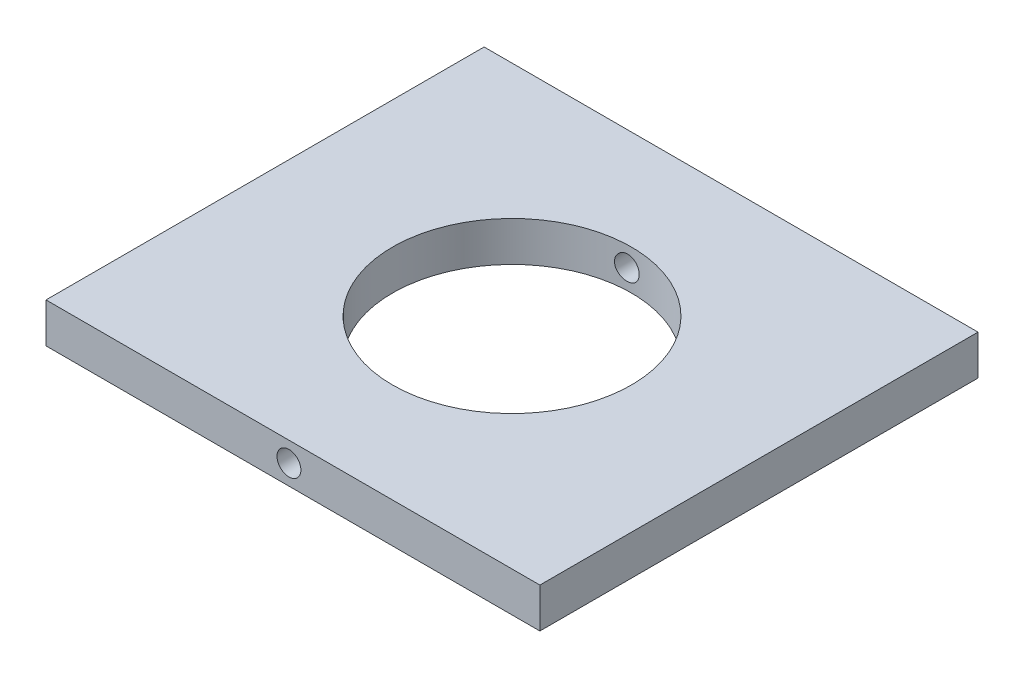
ISO-10303-21;
HEADER;
FILE_DESCRIPTION(('STEP AP214'),'2;1');
FILE_NAME('part.step','',(''),(''),'','','');
FILE_SCHEMA(('AUTOMOTIVE_DESIGN { 1 0 10303 214 1 1 1 1 }'));
ENDSEC;
DATA;
#1=APPLICATION_CONTEXT('core data for automotive mechanical design processes');
#2=APPLICATION_PROTOCOL_DEFINITION('international standard','automotive_design',2000,#1);
#3=PRODUCT_CONTEXT('',#1,'mechanical');
#4=PRODUCT('Part','Part','',(#3));
#5=PRODUCT_RELATED_PRODUCT_CATEGORY('part','',(#4));
#6=PRODUCT_DEFINITION_FORMATION('','',#4);
#7=PRODUCT_DEFINITION_CONTEXT('part definition',#1,'design');
#8=PRODUCT_DEFINITION('design','',#6,#7);
#9=PRODUCT_DEFINITION_SHAPE('','',#8);
#10=(LENGTH_UNIT() NAMED_UNIT(*) SI_UNIT(.MILLI.,.METRE.));
#11=(NAMED_UNIT(*) PLANE_ANGLE_UNIT() SI_UNIT($,.RADIAN.));
#12=(NAMED_UNIT(*) SI_UNIT($,.STERADIAN.) SOLID_ANGLE_UNIT());
#13=UNCERTAINTY_MEASURE_WITH_UNIT(LENGTH_MEASURE(1.E-05),#10,'distance_accuracy_value','');
#14=(GEOMETRIC_REPRESENTATION_CONTEXT(3) GLOBAL_UNCERTAINTY_ASSIGNED_CONTEXT((#13)) GLOBAL_UNIT_ASSIGNED_CONTEXT((#10,
#11,#12)) REPRESENTATION_CONTEXT('',''));
#15=CARTESIAN_POINT('',(0.,0.,0.));
#16=DIRECTION('',(0.,0.,1.));
#17=DIRECTION('',(1.,0.,0.));
#18=AXIS2_PLACEMENT_3D('',#15,#16,#17);
#19=CARTESIAN_POINT('',(-9.49999999999999,-45.,55.));
#20=DIRECTION('',(1.,0.,0.));
#21=DIRECTION('',(0.,0.,-1.));
#22=AXIS2_PLACEMENT_3D('',#19,#20,#21);
#23=PLANE('',#22);
#24=DIRECTION('',(0.,-1.,0.));
#25=VECTOR('',#24,1.);
#26=CARTESIAN_POINT('',(-9.49999999999999,-45.,0.));
#27=LINE('',#26,#25);
#28=CARTESIAN_POINT('',(-9.49999999999999,-45.,0.));
#29=VERTEX_POINT('',#28);
#30=CARTESIAN_POINT('',(-9.49999999999999,-50.,0.));
#31=VERTEX_POINT('',#30);
#32=EDGE_CURVE('E115',#29,#31,#27,.T.);
#33=ORIENTED_EDGE('',*,*,#32,.T.);
#34=DIRECTION('',(0.,0.,-1.));
#35=VECTOR('',#34,1.);
#36=CARTESIAN_POINT('',(-9.49999999999999,-50.,55.));
#37=LINE('',#36,#35);
#38=CARTESIAN_POINT('',(-9.49999999999999,-50.,55.));
#39=VERTEX_POINT('',#38);
#40=EDGE_CURVE('E11',#39,#31,#37,.T.);
#41=ORIENTED_EDGE('',*,*,#40,.F.);
#42=DIRECTION('',(0.,-1.,0.));
#43=VECTOR('',#42,1.);
#44=CARTESIAN_POINT('',(-9.49999999999999,-45.,55.));
#45=LINE('',#44,#43);
#46=CARTESIAN_POINT('',(-9.49999999999999,-45.,55.));
#47=VERTEX_POINT('',#46);
#48=EDGE_CURVE('E96',#47,#39,#45,.T.);
#49=ORIENTED_EDGE('',*,*,#48,.F.);
#50=DIRECTION('',(0.,0.,-1.));
#51=VECTOR('',#50,1.);
#52=CARTESIAN_POINT('',(-9.49999999999999,-45.,55.));
#53=LINE('',#52,#51);
#54=EDGE_CURVE('E63',#47,#29,#53,.T.);
#55=ORIENTED_EDGE('',*,*,#54,.T.);
#56=EDGE_LOOP('',(#33,#41,#49,#55));
#57=FACE_BOUND('',#56,.T.);
#58=ADVANCED_FACE('F39',(#57),#23,.F.);
#59=CARTESIAN_POINT('',(-9.49999999999999,-50.,55.));
#60=DIRECTION('',(0.,1.,0.));
#61=DIRECTION('',(0.,0.,1.));
#62=AXIS2_PLACEMENT_3D('',#59,#60,#61);
#63=PLANE('',#62);
#64=CARTESIAN_POINT('',(21.5,-50.,27.5));
#65=DIRECTION('',(0.,1.,0.));
#66=DIRECTION('',(0.,0.,1.));
#67=AXIS2_PLACEMENT_3D('',#64,#65,#66);
#68=CIRCLE('',#67,15.);
#69=CARTESIAN_POINT('',(21.5,-50.,42.5));
#70=VERTEX_POINT('',#69);
#71=EDGE_CURVE('E118',#70,#70,#68,.T.);
#72=ORIENTED_EDGE('',*,*,#71,.T.);
#73=EDGE_LOOP('',(#72));
#74=FACE_BOUND('',#73,.T.);
#75=DIRECTION('',(1.,0.,0.));
#76=VECTOR('',#75,1.);
#77=CARTESIAN_POINT('',(-9.49999999999999,-50.,0.));
#78=LINE('',#77,#76);
#79=CARTESIAN_POINT('',(52.5,-50.,0.));
#80=VERTEX_POINT('',#79);
#81=EDGE_CURVE('E102',#31,#80,#78,.T.);
#82=ORIENTED_EDGE('',*,*,#81,.T.);
#83=DIRECTION('',(0.,0.,-1.));
#84=VECTOR('',#83,1.);
#85=CARTESIAN_POINT('',(52.5,-50.,55.));
#86=LINE('',#85,#84);
#87=CARTESIAN_POINT('',(52.5,-50.,55.));
#88=VERTEX_POINT('',#87);
#89=EDGE_CURVE('E54',#88,#80,#86,.T.);
#90=ORIENTED_EDGE('',*,*,#89,.F.);
#91=DIRECTION('',(1.,0.,0.));
#92=VECTOR('',#91,1.);
#93=CARTESIAN_POINT('',(-9.49999999999999,-50.,55.));
#94=LINE('',#93,#92);
#95=EDGE_CURVE('E88',#39,#88,#94,.T.);
#96=ORIENTED_EDGE('',*,*,#95,.F.);
#97=ORIENTED_EDGE('',*,*,#40,.T.);
#98=EDGE_LOOP('',(#82,#90,#96,#97));
#99=FACE_BOUND('',#98,.T.);
#100=ADVANCED_FACE('F101',(#74,#99),#63,.F.);
#101=CARTESIAN_POINT('',(52.5,-45.,55.));
#102=DIRECTION('',(1.,0.,0.));
#103=DIRECTION('',(0.,0.,-1.));
#104=AXIS2_PLACEMENT_3D('',#101,#102,#103);
#105=PLANE('',#104);
#106=DIRECTION('',(0.,-1.,0.));
#107=VECTOR('',#106,1.);
#108=CARTESIAN_POINT('',(52.5,-45.,0.));
#109=LINE('',#108,#107);
#110=CARTESIAN_POINT('',(52.5,-45.,0.));
#111=VERTEX_POINT('',#110);
#112=EDGE_CURVE('E121',#111,#80,#109,.T.);
#113=ORIENTED_EDGE('',*,*,#112,.F.);
#114=DIRECTION('',(0.,0.,-1.));
#115=VECTOR('',#114,1.);
#116=CARTESIAN_POINT('',(52.5,-45.,55.));
#117=LINE('',#116,#115);
#118=CARTESIAN_POINT('',(52.5,-45.,55.));
#119=VERTEX_POINT('',#118);
#120=EDGE_CURVE('E77',#119,#111,#117,.T.);
#121=ORIENTED_EDGE('',*,*,#120,.F.);
#122=DIRECTION('',(0.,-1.,0.));
#123=VECTOR('',#122,1.);
#124=CARTESIAN_POINT('',(52.5,-45.,55.));
#125=LINE('',#124,#123);
#126=EDGE_CURVE('E95',#119,#88,#125,.T.);
#127=ORIENTED_EDGE('',*,*,#126,.T.);
#128=ORIENTED_EDGE('',*,*,#89,.T.);
#129=EDGE_LOOP('',(#113,#121,#127,#128));
#130=FACE_BOUND('',#129,.T.);
#131=ADVANCED_FACE('F107',(#130),#105,.T.);
#132=CARTESIAN_POINT('',(-9.49999999999999,-45.,55.));
#133=DIRECTION('',(0.,1.,0.));
#134=DIRECTION('',(0.,0.,1.));
#135=AXIS2_PLACEMENT_3D('',#132,#133,#134);
#136=PLANE('',#135);
#137=CARTESIAN_POINT('',(21.5,-45.,27.5));
#138=DIRECTION('',(0.,1.,0.));
#139=DIRECTION('',(0.,0.,1.));
#140=AXIS2_PLACEMENT_3D('',#137,#138,#139);
#141=CIRCLE('',#140,15.);
#142=CARTESIAN_POINT('',(21.5,-45.,42.5));
#143=VERTEX_POINT('',#142);
#144=EDGE_CURVE('E189',#143,#143,#141,.T.);
#145=ORIENTED_EDGE('',*,*,#144,.F.);
#146=EDGE_LOOP('',(#145));
#147=FACE_BOUND('',#146,.T.);
#148=DIRECTION('',(1.,0.,0.));
#149=VECTOR('',#148,1.);
#150=CARTESIAN_POINT('',(-9.49999999999999,-45.,0.));
#151=LINE('',#150,#149);
#152=EDGE_CURVE('E124',#29,#111,#151,.T.);
#153=ORIENTED_EDGE('',*,*,#152,.F.);
#154=ORIENTED_EDGE('',*,*,#54,.F.);
#155=DIRECTION('',(1.,0.,0.));
#156=VECTOR('',#155,1.);
#157=CARTESIAN_POINT('',(-9.49999999999999,-45.,55.));
#158=LINE('',#157,#156);
#159=EDGE_CURVE('E109',#47,#119,#158,.T.);
#160=ORIENTED_EDGE('',*,*,#159,.T.);
#161=ORIENTED_EDGE('',*,*,#120,.T.);
#162=EDGE_LOOP('',(#153,#154,#160,#161));
#163=FACE_BOUND('',#162,.T.);
#164=ADVANCED_FACE('F160',(#147,#163),#136,.T.);
#165=CARTESIAN_POINT('',(0.,0.,55.));
#166=DIRECTION('',(0.,0.,1.));
#167=DIRECTION('',(1.,0.,0.));
#168=AXIS2_PLACEMENT_3D('',#165,#166,#167);
#169=PLANE('',#168);
#170=CARTESIAN_POINT('',(21.,-47.5,55.));
#171=DIRECTION('',(0.,0.,1.));
#172=DIRECTION('',(1.,0.,0.));
#173=AXIS2_PLACEMENT_3D('',#170,#171,#172);
#174=CIRCLE('',#173,1.5);
#175=CARTESIAN_POINT('',(22.5,-47.5,55.));
#176=VERTEX_POINT('',#175);
#177=EDGE_CURVE('E181',#176,#176,#174,.T.);
#178=ORIENTED_EDGE('',*,*,#177,.F.);
#179=EDGE_LOOP('',(#178));
#180=FACE_BOUND('',#179,.T.);
#181=ORIENTED_EDGE('',*,*,#48,.T.);
#182=ORIENTED_EDGE('',*,*,#95,.T.);
#183=ORIENTED_EDGE('',*,*,#126,.F.);
#184=ORIENTED_EDGE('',*,*,#159,.F.);
#185=EDGE_LOOP('',(#181,#182,#183,#184));
#186=FACE_BOUND('',#185,.T.);
#187=ADVANCED_FACE('F92',(#180,#186),#169,.T.);
#188=CARTESIAN_POINT('',(0.,0.,0.));
#189=DIRECTION('',(0.,0.,1.));
#190=DIRECTION('',(1.,0.,0.));
#191=AXIS2_PLACEMENT_3D('',#188,#189,#190);
#192=PLANE('',#191);
#193=CARTESIAN_POINT('',(21.,-47.5,0.));
#194=DIRECTION('',(0.,0.,1.));
#195=DIRECTION('',(1.,0.,0.));
#196=AXIS2_PLACEMENT_3D('',#193,#194,#195);
#197=CIRCLE('',#196,1.5);
#198=CARTESIAN_POINT('',(22.5,-47.5,0.));
#199=VERTEX_POINT('',#198);
#200=EDGE_CURVE('E137',#199,#199,#197,.T.);
#201=ORIENTED_EDGE('',*,*,#200,.T.);
#202=EDGE_LOOP('',(#201));
#203=FACE_BOUND('',#202,.T.);
#204=ORIENTED_EDGE('',*,*,#32,.F.);
#205=ORIENTED_EDGE('',*,*,#152,.T.);
#206=ORIENTED_EDGE('',*,*,#112,.T.);
#207=ORIENTED_EDGE('',*,*,#81,.F.);
#208=EDGE_LOOP('',(#204,#205,#206,#207));
#209=FACE_BOUND('',#208,.T.);
#210=ADVANCED_FACE('F159',(#203,#209),#192,.F.);
#211=CARTESIAN_POINT('',(21.5,-50.,27.5));
#212=DIRECTION('',(0.,1.,0.));
#213=DIRECTION('',(0.,0.,1.));
#214=AXIS2_PLACEMENT_3D('',#211,#212,#213);
#215=CYLINDRICAL_SURFACE('',#214,15.);
#216=CARTESIAN_POINT('',(21.5,-48.9142135623731,42.5));
#217=CARTESIAN_POINT('',(21.5793489046953,-48.8861556413774,42.4999993256677));
#218=CARTESIAN_POINT('',(21.6563839440422,-48.8513851314622,42.4993645775969));
#219=CARTESIAN_POINT('',(21.8035801266245,-48.7693981366301,42.4971091004472));
#220=CARTESIAN_POINT('',(21.8737334044825,-48.7221676330219,42.4954872580889));
#221=CARTESIAN_POINT('',(22.0050828586709,-48.6166460523482,42.4916380121305));
#222=CARTESIAN_POINT('',(22.0662840996792,-48.5583612725223,42.4894109529903));
#223=CARTESIAN_POINT('',(22.17803333308,-48.4323770982435,42.4847725074987));
#224=CARTESIAN_POINT('',(22.2285836757154,-48.3646797862582,42.4823611619724));
#225=CARTESIAN_POINT('',(22.3177151503569,-48.2216248229667,42.4777616678286));
#226=CARTESIAN_POINT('',(22.3562727236393,-48.1462524752806,42.4755739641216));
#227=CARTESIAN_POINT('',(22.4201874403076,-47.9900876841878,42.471783002729));
#228=CARTESIAN_POINT('',(22.4455442384585,-47.9092950990899,42.4701797603289));
#229=CARTESIAN_POINT('',(22.4823133968956,-47.7446541895481,42.4678122386669));
#230=CARTESIAN_POINT('',(22.4937372141484,-47.660808434212,42.4670472701524));
#231=CARTESIAN_POINT('',(22.5023487909593,-47.4923863764083,42.4664730819749));
#232=CARTESIAN_POINT('',(22.4995367306989,-47.4078100832005,42.4666638502153));
#233=CARTESIAN_POINT('',(22.4797763448136,-47.2404888780095,42.4679702674351));
#234=CARTESIAN_POINT('',(22.4628535882163,-47.1577409311992,42.4690842435105));
#235=CARTESIAN_POINT('',(22.4153904113498,-46.9962617408119,42.4720613506146));
#236=CARTESIAN_POINT('',(22.3848498866046,-46.9175305280567,42.4739244873907));
#237=CARTESIAN_POINT('',(22.3109832460542,-46.7662309951083,42.4781063281337));
#238=CARTESIAN_POINT('',(22.2676445510167,-46.6936688292266,42.4804254795613));
#239=CARTESIAN_POINT('',(22.1694173544105,-46.556837167034,42.4851356379302));
#240=CARTESIAN_POINT('',(22.1145286829731,-46.49256779271,42.4875266459281));
#241=CARTESIAN_POINT('',(21.994639821212,-46.3740292349444,42.4919620957152));
#242=CARTESIAN_POINT('',(21.929621954393,-46.3197779027287,42.4940059183432));
#243=CARTESIAN_POINT('',(21.7913839091827,-46.2229596331571,42.4973286726416));
#244=CARTESIAN_POINT('',(21.7181638380253,-46.180392543069,42.4986076143106));
#245=CARTESIAN_POINT('',(21.5657261140957,-46.1082191391755,42.5000491311427));
#246=CARTESIAN_POINT('',(21.4865183153531,-46.0785920521346,42.5002135017914));
#247=CARTESIAN_POINT('',(21.3242641236757,-46.0330465029317,42.4991897708701));
#248=CARTESIAN_POINT('',(21.2412178279161,-46.0171276939317,42.4980017035204));
#249=CARTESIAN_POINT('',(21.0739374649206,-45.9994720288416,42.494180407971));
#250=CARTESIAN_POINT('',(20.9897081139393,-45.997689422248,42.4915518712708));
#251=CARTESIAN_POINT('',(20.8221905682874,-46.0082134025993,42.4849124842659));
#252=CARTESIAN_POINT('',(20.7389023782113,-46.0205200582909,42.4809016272163));
#253=CARTESIAN_POINT('',(20.5755273311078,-46.0588647009327,42.4717084896072));
#254=CARTESIAN_POINT('',(20.4954438844768,-46.0849169182984,42.4665249982331));
#255=CARTESIAN_POINT('',(20.3407991472691,-46.1500026635412,42.4553425200916));
#256=CARTESIAN_POINT('',(20.2662380706393,-46.189036694037,42.4493435017545));
#257=CARTESIAN_POINT('',(20.1242965695414,-46.279240280311,42.436952534668));
#258=CARTESIAN_POINT('',(20.0569591332515,-46.3304772101334,42.4305585558533));
#259=CARTESIAN_POINT('',(19.9318277553795,-46.4435349595608,42.4179354698428));
#260=CARTESIAN_POINT('',(19.8740340415482,-46.5053560316736,42.4117063665846));
#261=CARTESIAN_POINT('',(19.7694695097376,-46.6380544763858,42.3999345083866));
#262=CARTESIAN_POINT('',(19.722730321175,-46.7089569615317,42.3943937439053));
#263=CARTESIAN_POINT('',(19.6418387956962,-46.8576889090585,42.38451896798));
#264=CARTESIAN_POINT('',(19.6076860444328,-46.9355181433051,42.3801849168119));
#265=CARTESIAN_POINT('',(19.5531199681978,-47.0954732422837,42.37314413208));
#266=CARTESIAN_POINT('',(19.5326365213833,-47.177574812432,42.370429100907));
#267=CARTESIAN_POINT('',(19.5057431642909,-47.3440894123457,42.3668465728869));
#268=CARTESIAN_POINT('',(19.4993325189551,-47.4285023211508,42.3659789795436));
#269=CARTESIAN_POINT('',(19.5007722049463,-47.596571974347,42.3661726041052));
#270=CARTESIAN_POINT('',(19.5085165669409,-47.6802296641693,42.3672194895831));
#271=CARTESIAN_POINT('',(19.5378265894971,-47.8450428845901,42.3711159980776));
#272=CARTESIAN_POINT('',(19.5593922379168,-47.9261984173866,42.3739656195105));
#273=CARTESIAN_POINT('',(19.6157046499195,-48.0837136613963,42.381203951234));
#274=CARTESIAN_POINT('',(19.6504500588193,-48.1600738645582,42.385592503342));
#275=CARTESIAN_POINT('',(19.7321206787363,-48.3058947763652,42.395512337427));
#276=CARTESIAN_POINT('',(19.7790464491238,-48.3753551679409,42.4010436718827));
#277=CARTESIAN_POINT('',(19.8841460907862,-48.5059558833087,42.4128074045266));
#278=CARTESIAN_POINT('',(19.9424003684782,-48.56703106507,42.4190446724415));
#279=CARTESIAN_POINT('',(20.0683007667286,-48.6785624035999,42.4316520079097));
#280=CARTESIAN_POINT('',(20.1359468927769,-48.7290185541611,42.4380220755407));
#281=CARTESIAN_POINT('',(20.2791367663266,-48.8181446500193,42.4504072504638));
#282=CARTESIAN_POINT('',(20.3547204382205,-48.8567507674297,42.4564202994619));
#283=CARTESIAN_POINT('',(20.5113836006404,-48.9207084940275,42.4675915977466));
#284=CARTESIAN_POINT('',(20.5924642380484,-48.9460573275539,42.4727496678731));
#285=CARTESIAN_POINT('',(20.7576207721119,-48.9826984707764,42.4818456482809));
#286=CARTESIAN_POINT('',(20.8416899416331,-48.9940205197423,42.485786126703));
#287=CARTESIAN_POINT('',(21.0105235010272,-49.0023371292172,42.4922489332933));
#288=CARTESIAN_POINT('',(21.0952869874262,-48.9993480352155,42.4947728756789));
#289=CARTESIAN_POINT('',(21.2337972992228,-48.9826918823192,42.4977379418316));
#290=CARTESIAN_POINT('',(21.2880597901608,-48.9731086373461,42.4985983769998));
#291=CARTESIAN_POINT('',(21.3952114731314,-48.9480453094291,42.499729624872));
#292=CARTESIAN_POINT('',(21.4481006732698,-48.9325652612997,42.500000441057));
#293=CARTESIAN_POINT('',(21.5,-48.9142135623731,42.5));
#294=B_SPLINE_CURVE_WITH_KNOTS('',3,(#216,#217,#218,#219,#220,#221,#222,#223,#224,#225,#226,
#227,#228,#229,#230,#231,#232,#233,#234,#235,#236,#237,#238,#239,#240,#241,#242,#243,#244,#245,
#246,#247,#248,#249,#250,#251,#252,#253,#254,#255,#256,#257,#258,#259,#260,#261,#262,#263,#264,
#265,#266,#267,#268,#269,#270,#271,#272,#273,#274,#275,#276,#277,#278,#279,#280,#281,#282,#283,
#284,#285,#286,#287,#288,#289,#290,#291,#292,#293),.UNSPECIFIED.,.T.,.F.,(4,2,2,2,2,2,2,2,2,2,2,
2,2,2,2,2,2,2,2,2,2,2,2,2,2,2,2,2,2,2,2,2,2,2,2,2,2,2,4),(0.,0.252289352065681,
0.504863773516696,0.757294741876417,1.00966994997479,1.2625378403686,1.51541234358866,
1.76807876984714,2.02074199814989,2.27294838512454,2.52515670706681,2.77761375261048,
3.03007451137267,3.28298088005088,3.53588394267167,3.78837950154055,4.04086867174362,
4.29254034939163,4.54421325504424,4.79614722370967,5.04809094767217,5.30145932546497,
5.5548337487553,5.80892459117777,6.06300706814825,6.31577590313442,6.56853153505478,
6.81940269466485,7.07027363388889,7.32111879430022,7.57197547655262,7.8246823217772,
8.07738931471793,8.33143449967825,8.58553285249174,8.83909154464765,9.09236070357056,
9.25737526637084,9.4223888549476),.UNSPECIFIED.);
#295=CARTESIAN_POINT('',(21.5,-48.9142135623731,42.5));
#296=VERTEX_POINT('',#295);
#297=EDGE_CURVE('E42',#296,#296,#294,.T.);
#298=ORIENTED_EDGE('',*,*,#297,.T.);
#299=EDGE_LOOP('',(#298));
#300=FACE_BOUND('',#299,.T.);
#301=CARTESIAN_POINT('',(22.5,-47.5,12.5333704529042));
#302=CARTESIAN_POINT('',(22.4999963874704,-47.5841745462208,12.5333695929081));
#303=CARTESIAN_POINT('',(22.4928911433546,-47.668404634886,12.5328902227829));
#304=CARTESIAN_POINT('',(22.4646505187397,-47.8345340706255,12.5310440589166));
#305=CARTESIAN_POINT('',(22.4434997007762,-47.9164307496475,12.5296762887729));
#306=CARTESIAN_POINT('',(22.3877785961566,-48.0754680406484,12.526268878861));
#307=CARTESIAN_POINT('',(22.3532152984175,-48.1526111054007,12.5242295890891));
#308=CARTESIAN_POINT('',(22.2716588829155,-48.2999850297905,12.5198063319634));
#309=CARTESIAN_POINT('',(22.2246683718339,-48.3702173347667,12.5174224369401));
#310=CARTESIAN_POINT('',(22.1194978030878,-48.5019164638711,12.5127057369165));
#311=CARTESIAN_POINT('',(22.0613005388519,-48.5633695525615,12.5103730167041));
#312=CARTESIAN_POINT('',(21.9354029081612,-48.6756425833353,12.5061885172916));
#313=CARTESIAN_POINT('',(21.86770224592,-48.7264621943367,12.504336753066));
#314=CARTESIAN_POINT('',(21.7247319921425,-48.8160077067616,12.5015134560538));
#315=CARTESIAN_POINT('',(21.6494642886509,-48.854736615072,12.5005417042988));
#316=CARTESIAN_POINT('',(21.4934899184782,-48.9190073674228,12.4997988960253));
#317=CARTESIAN_POINT('',(21.4127833990674,-48.944549568366,12.5000278070085));
#318=CARTESIAN_POINT('',(21.2485162285424,-48.9816566581021,12.50188421802));
#319=CARTESIAN_POINT('',(21.1649659272131,-48.9932676068463,12.5035070786168));
#320=CARTESIAN_POINT('',(20.9971419601028,-49.0023493634742,12.5081962573918));
#321=CARTESIAN_POINT('',(20.9128683021898,-48.9998203249628,12.5112625598893));
#322=CARTESIAN_POINT('',(20.746070082625,-48.9807294532604,12.5187265334359));
#323=CARTESIAN_POINT('',(20.6635439266766,-48.9641810304976,12.5231229295836));
#324=CARTESIAN_POINT('',(20.502469750133,-48.9175661500808,12.5329879748528));
#325=CARTESIAN_POINT('',(20.4239218542722,-48.8874992688607,12.5384566575688));
#326=CARTESIAN_POINT('',(20.2726334665399,-48.8145429436038,12.5501050154545));
#327=CARTESIAN_POINT('',(20.1999214497679,-48.7715949618916,12.5562878554821));
#328=CARTESIAN_POINT('',(20.062726854686,-48.67413787021,12.5688580746116));
#329=CARTESIAN_POINT('',(19.998244571318,-48.6196283460777,12.5752454610339));
#330=CARTESIAN_POINT('',(19.8790173880163,-48.5002733898108,12.5877220576778));
#331=CARTESIAN_POINT('',(19.8243206831381,-48.4353796296967,12.5938096905316));
#332=CARTESIAN_POINT('',(19.726604550931,-48.2972578946835,12.6051184618776));
#333=CARTESIAN_POINT('',(19.6835849728654,-48.2240300273843,12.6103396115547));
#334=CARTESIAN_POINT('',(19.6105642408773,-48.071489778363,12.619429117526));
#335=CARTESIAN_POINT('',(19.5805313896492,-47.9921927736357,12.6233007630823));
#336=CARTESIAN_POINT('',(19.5342253655319,-47.829617069531,12.6293483474529));
#337=CARTESIAN_POINT('',(19.5179514490894,-47.7463385855757,12.6315243779003));
#338=CARTESIAN_POINT('',(19.4997269557841,-47.5788664898953,12.6339651217385));
#339=CARTESIAN_POINT('',(19.4976646059317,-47.4946852471412,12.6342447499255));
#340=CARTESIAN_POINT('',(19.5076288598801,-47.3271777996346,12.6329060808437));
#341=CARTESIAN_POINT('',(19.5196551327994,-47.2438515748477,12.631287828148));
#342=CARTESIAN_POINT('',(19.5573714124406,-47.0807031958204,12.6263134907291));
#343=CARTESIAN_POINT('',(19.583015551178,-47.0008702467508,12.6229632407527));
#344=CARTESIAN_POINT('',(19.6471882252498,-46.8466416275286,12.614835287558));
#345=CARTESIAN_POINT('',(19.6857171822545,-46.7722461354201,12.6100575376237));
#346=CARTESIAN_POINT('',(19.774807478022,-46.6305484254834,12.5994722697532));
#347=CARTESIAN_POINT('',(19.8254345191175,-46.5632879415596,12.5936591745632));
#348=CARTESIAN_POINT('',(19.9371801866093,-46.43818584019,12.5815300723033));
#349=CARTESIAN_POINT('',(19.998299296757,-46.3803446572739,12.575214042052));
#350=CARTESIAN_POINT('',(20.1298117143271,-46.2752936015666,12.5625647789989));
#351=CARTESIAN_POINT('',(20.2002688675967,-46.2281636006478,12.5562317518763));
#352=CARTESIAN_POINT('',(20.3481413185295,-46.1464055752283,12.5441075914105));
#353=CARTESIAN_POINT('',(20.4255566233509,-46.1117775635892,12.5383164586248));
#354=CARTESIAN_POINT('',(20.5851857130104,-46.0560202411196,12.5277086308177));
#355=CARTESIAN_POINT('',(20.6674003368215,-46.0348932981809,12.5228921068296));
#356=CARTESIAN_POINT('',(20.8342766351566,-46.0067838391504,12.5145474534435));
#357=CARTESIAN_POINT('',(20.9189382262958,-45.999800841654,12.5110192801983));
#358=CARTESIAN_POINT('',(21.0877984334235,-46.0002066847374,12.5054280924809));
#359=CARTESIAN_POINT('',(21.171996977761,-46.0075149882624,12.5033569564605));
#360=CARTESIAN_POINT('',(21.3379980208456,-46.0361519619262,12.5006450588275));
#361=CARTESIAN_POINT('',(21.4198005613513,-46.0574803875634,12.5000042722714));
#362=CARTESIAN_POINT('',(21.5784119797722,-46.1134611481949,12.4999957805253));
#363=CARTESIAN_POINT('',(21.6552361375558,-46.1480702130608,12.5006239688947));
#364=CARTESIAN_POINT('',(21.8020063261063,-46.2296322443059,12.5028607446139));
#365=CARTESIAN_POINT('',(21.8719524949365,-46.2765849628389,12.5044693122797));
#366=CARTESIAN_POINT('',(22.0031457676775,-46.3816194569568,12.508296685813));
#367=CARTESIAN_POINT('',(22.0643739530317,-46.4397248121207,12.5105167890323));
#368=CARTESIAN_POINT('',(22.1762482686432,-46.5653786843704,12.5151465793068));
#369=CARTESIAN_POINT('',(22.2268918398288,-46.632929478533,12.5175563120159));
#370=CARTESIAN_POINT('',(22.3162998721156,-46.7757892737981,12.5221606551995));
#371=CARTESIAN_POINT('',(22.3550250986959,-46.8511228310123,12.5243545393254));
#372=CARTESIAN_POINT('',(22.4192374383493,-47.0071822007927,12.5281582124196));
#373=CARTESIAN_POINT('',(22.4447391736025,-47.087901945456,12.5297686459554));
#374=CARTESIAN_POINT('',(22.4754756767945,-47.224223963744,12.5317473452467));
#375=CARTESIAN_POINT('',(22.4846599240471,-47.278964820295,12.5323521174781));
#376=CARTESIAN_POINT('',(22.4969232702306,-47.3891290851527,12.5331639542139));
#377=CARTESIAN_POINT('',(22.5000023796477,-47.4445524922867,12.5333710194014));
#378=CARTESIAN_POINT('',(22.5,-47.5,12.5333704529042));
#379=B_SPLINE_CURVE_WITH_KNOTS('',3,(#301,#302,#303,#304,#305,#306,#307,#308,#309,#310,#311,
#312,#313,#314,#315,#316,#317,#318,#319,#320,#321,#322,#323,#324,#325,#326,#327,#328,#329,#330,
#331,#332,#333,#334,#335,#336,#337,#338,#339,#340,#341,#342,#343,#344,#345,#346,#347,#348,#349,
#350,#351,#352,#353,#354,#355,#356,#357,#358,#359,#360,#361,#362,#363,#364,#365,#366,#367,#368,
#369,#370,#371,#372,#373,#374,#375,#376,#377,#378),.UNSPECIFIED.,.T.,.F.,(4,2,2,2,2,2,2,2,2,2,2,
2,2,2,2,2,2,2,2,2,2,2,2,2,2,2,2,2,2,2,2,2,2,2,2,2,2,2,4),(0.,0.252321559756462,0.50492090569567,
0.75738880461755,1.00980378885375,1.2626094602191,1.51542300172438,1.76817361980179,
2.02091739673691,2.27282322096294,2.52472630870177,2.77638870692042,3.02805899088434,
3.28089077171019,3.53373161112383,3.78778535274912,4.04183581471336,4.29526265510977,
4.54867579906675,4.8000935680239,5.05150543237038,5.30207580759321,5.55265438381906,
5.80462603351772,6.05660930384242,6.31041406105925,6.56421907937876,6.81806859921018,
7.07190947884862,7.32432398801367,7.57673409535772,7.82832870460605,8.0799182625118,
8.33204572529215,8.58423407530245,8.83724394798034,9.08997344932426,9.25618314440793,
9.4223925540093),.UNSPECIFIED.);
#380=CARTESIAN_POINT('',(22.5,-47.5,12.5333704529042));
#381=VERTEX_POINT('',#380);
#382=EDGE_CURVE('E131',#381,#381,#379,.T.);
#383=ORIENTED_EDGE('',*,*,#382,.T.);
#384=EDGE_LOOP('',(#383));
#385=FACE_BOUND('',#384,.T.);
#386=ORIENTED_EDGE('',*,*,#71,.F.);
#387=EDGE_LOOP('',(#386));
#388=FACE_BOUND('',#387,.T.);
#389=ORIENTED_EDGE('',*,*,#144,.T.);
#390=EDGE_LOOP('',(#389));
#391=FACE_BOUND('',#390,.T.);
#392=ADVANCED_FACE('F138',(#300,#385,#388,#391),#215,.F.);
#393=CARTESIAN_POINT('',(21.,-47.5,0.));
#394=DIRECTION('',(0.,0.,1.));
#395=DIRECTION('',(1.,0.,0.));
#396=AXIS2_PLACEMENT_3D('',#393,#394,#395);
#397=CYLINDRICAL_SURFACE('',#396,1.5);
#398=ORIENTED_EDGE('',*,*,#200,.F.);
#399=EDGE_LOOP('',(#398));
#400=FACE_BOUND('',#399,.T.);
#401=ORIENTED_EDGE('',*,*,#382,.F.);
#402=EDGE_LOOP('',(#401));
#403=FACE_BOUND('',#402,.T.);
#404=ADVANCED_FACE('F144',(#400,#403),#397,.F.);
#405=ORIENTED_EDGE('',*,*,#177,.T.);
#406=EDGE_LOOP('',(#405));
#407=FACE_BOUND('',#406,.T.);
#408=ORIENTED_EDGE('',*,*,#297,.F.);
#409=EDGE_LOOP('',(#408));
#410=FACE_BOUND('',#409,.T.);
#411=ADVANCED_FACE('F141',(#407,#410),#397,.F.);
#412=CLOSED_SHELL('',(#58,#100,#131,#164,#187,#210,#392,#404,#411));
#413=MANIFOLD_SOLID_BREP('B2',#412);
#414=ADVANCED_BREP_SHAPE_REPRESENTATION('',(#18,#413),#14);
#415=SHAPE_DEFINITION_REPRESENTATION(#9,#414);
ENDSEC;
END-ISO-10303-21;
